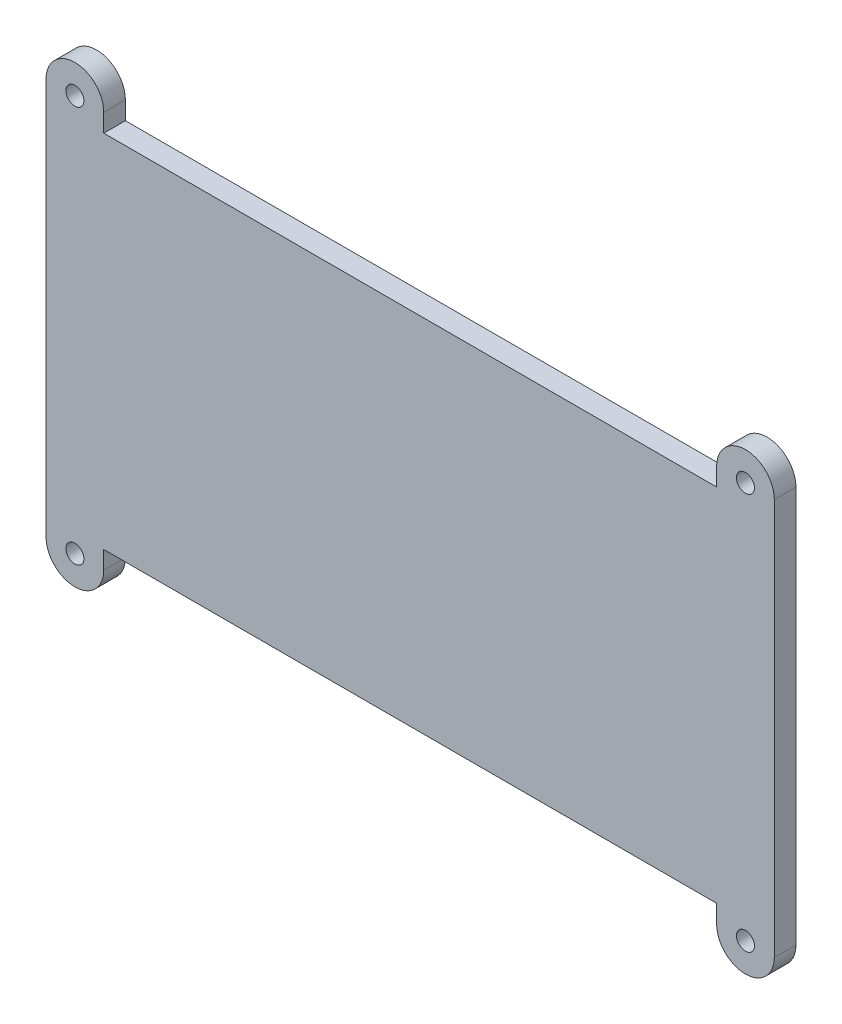
ISO-10303-21;
HEADER;
FILE_DESCRIPTION(('STEP AP214'),'2;1');
FILE_NAME('part.step','',(''),(''),'','','');
FILE_SCHEMA(('AUTOMOTIVE_DESIGN { 1 0 10303 214 1 1 1 1 }'));
ENDSEC;
DATA;
#1=APPLICATION_CONTEXT('core data for automotive mechanical design processes');
#2=APPLICATION_PROTOCOL_DEFINITION('international standard','automotive_design',2000,#1);
#3=PRODUCT_CONTEXT('',#1,'mechanical');
#4=PRODUCT('Part','Part','',(#3));
#5=PRODUCT_RELATED_PRODUCT_CATEGORY('part','',(#4));
#6=PRODUCT_DEFINITION_FORMATION('','',#4);
#7=PRODUCT_DEFINITION_CONTEXT('part definition',#1,'design');
#8=PRODUCT_DEFINITION('design','',#6,#7);
#9=PRODUCT_DEFINITION_SHAPE('','',#8);
#10=(LENGTH_UNIT() NAMED_UNIT(*) SI_UNIT(.MILLI.,.METRE.));
#11=(NAMED_UNIT(*) PLANE_ANGLE_UNIT() SI_UNIT($,.RADIAN.));
#12=(NAMED_UNIT(*) SI_UNIT($,.STERADIAN.) SOLID_ANGLE_UNIT());
#13=UNCERTAINTY_MEASURE_WITH_UNIT(LENGTH_MEASURE(1.E-05),#10,'distance_accuracy_value','');
#14=(GEOMETRIC_REPRESENTATION_CONTEXT(3) GLOBAL_UNCERTAINTY_ASSIGNED_CONTEXT((#13)) GLOBAL_UNIT_ASSIGNED_CONTEXT((#10,
#11,#12)) REPRESENTATION_CONTEXT('',''));
#15=CARTESIAN_POINT('',(0.,0.,0.));
#16=DIRECTION('',(0.,0.,1.));
#17=DIRECTION('',(1.,0.,0.));
#18=AXIS2_PLACEMENT_3D('',#15,#16,#17);
#19=CARTESIAN_POINT('',(46.5,-27.5,3.));
#20=DIRECTION('',(0.,0.,1.));
#21=DIRECTION('',(1.,0.,0.));
#22=AXIS2_PLACEMENT_3D('',#19,#20,#21);
#23=PLANE('',#22);
#24=CARTESIAN_POINT('',(46.5,-27.5,3.));
#25=DIRECTION('',(0.,0.,1.));
#26=DIRECTION('',(1.,0.,0.));
#27=AXIS2_PLACEMENT_3D('',#24,#25,#26);
#28=CIRCLE('',#27,1.25);
#29=CARTESIAN_POINT('',(47.75,-27.5,3.));
#30=VERTEX_POINT('',#29);
#31=EDGE_CURVE('E470',#30,#30,#28,.T.);
#32=ORIENTED_EDGE('',*,*,#31,.F.);
#33=EDGE_LOOP('',(#32));
#34=FACE_BOUND('',#33,.T.);
#35=CARTESIAN_POINT('',(-46.5,27.5,3.));
#36=DIRECTION('',(0.,0.,1.));
#37=DIRECTION('',(1.,0.,0.));
#38=AXIS2_PLACEMENT_3D('',#35,#36,#37);
#39=CIRCLE('',#38,1.25);
#40=CARTESIAN_POINT('',(-45.25,27.5,3.));
#41=VERTEX_POINT('',#40);
#42=EDGE_CURVE('E174',#41,#41,#39,.T.);
#43=ORIENTED_EDGE('',*,*,#42,.F.);
#44=EDGE_LOOP('',(#43));
#45=FACE_BOUND('',#44,.T.);
#46=DIRECTION('',(0.,1.,0.));
#47=VECTOR('',#46,1.);
#48=CARTESIAN_POINT('',(50.5,27.5,3.));
#49=LINE('',#48,#47);
#50=CARTESIAN_POINT('',(50.5,-27.5,3.));
#51=VERTEX_POINT('',#50);
#52=CARTESIAN_POINT('',(50.5,27.5,3.));
#53=VERTEX_POINT('',#52);
#54=EDGE_CURVE('E57',#51,#53,#49,.T.);
#55=ORIENTED_EDGE('',*,*,#54,.T.);
#56=CARTESIAN_POINT('',(46.5,27.5,3.));
#57=DIRECTION('',(0.,0.,1.));
#58=DIRECTION('',(1.,0.,0.));
#59=AXIS2_PLACEMENT_3D('',#56,#57,#58);
#60=CIRCLE('',#59,4.);
#61=CARTESIAN_POINT('',(42.5,27.5,3.));
#62=VERTEX_POINT('',#61);
#63=EDGE_CURVE('E114',#53,#62,#60,.T.);
#64=ORIENTED_EDGE('',*,*,#63,.T.);
#65=DIRECTION('',(0.,-1.,0.));
#66=VECTOR('',#65,1.);
#67=CARTESIAN_POINT('',(42.5,27.5,3.));
#68=LINE('',#67,#66);
#69=CARTESIAN_POINT('',(42.5,25.,3.));
#70=VERTEX_POINT('',#69);
#71=EDGE_CURVE('E241',#62,#70,#68,.T.);
#72=ORIENTED_EDGE('',*,*,#71,.T.);
#73=DIRECTION('',(-1.,0.,0.));
#74=VECTOR('',#73,1.);
#75=CARTESIAN_POINT('',(-42.5,25.,3.));
#76=LINE('',#75,#74);
#77=CARTESIAN_POINT('',(-42.5,25.,3.));
#78=VERTEX_POINT('',#77);
#79=EDGE_CURVE('E259',#70,#78,#76,.T.);
#80=ORIENTED_EDGE('',*,*,#79,.T.);
#81=DIRECTION('',(0.,1.,0.));
#82=VECTOR('',#81,1.);
#83=CARTESIAN_POINT('',(-42.5,27.5,3.));
#84=LINE('',#83,#82);
#85=CARTESIAN_POINT('',(-42.5,27.5,3.));
#86=VERTEX_POINT('',#85);
#87=EDGE_CURVE('E255',#78,#86,#84,.T.);
#88=ORIENTED_EDGE('',*,*,#87,.T.);
#89=CARTESIAN_POINT('',(-46.5,27.5,3.));
#90=DIRECTION('',(0.,0.,1.));
#91=DIRECTION('',(1.,0.,0.));
#92=AXIS2_PLACEMENT_3D('',#89,#90,#91);
#93=CIRCLE('',#92,4.00000000000001);
#94=CARTESIAN_POINT('',(-50.5,27.5,3.));
#95=VERTEX_POINT('',#94);
#96=EDGE_CURVE('E258',#86,#95,#93,.T.);
#97=ORIENTED_EDGE('',*,*,#96,.T.);
#98=DIRECTION('',(0.,-1.,0.));
#99=VECTOR('',#98,1.);
#100=CARTESIAN_POINT('',(-50.5,27.5,3.));
#101=LINE('',#100,#99);
#102=CARTESIAN_POINT('',(-50.5,-27.5,3.));
#103=VERTEX_POINT('',#102);
#104=EDGE_CURVE('E263',#95,#103,#101,.T.);
#105=ORIENTED_EDGE('',*,*,#104,.T.);
#106=CARTESIAN_POINT('',(-46.5,-27.5,3.));
#107=DIRECTION('',(0.,0.,1.));
#108=DIRECTION('',(1.,0.,0.));
#109=AXIS2_PLACEMENT_3D('',#106,#107,#108);
#110=CIRCLE('',#109,4.00000000000001);
#111=CARTESIAN_POINT('',(-42.5,-27.5,3.));
#112=VERTEX_POINT('',#111);
#113=EDGE_CURVE('E270',#103,#112,#110,.T.);
#114=ORIENTED_EDGE('',*,*,#113,.T.);
#115=DIRECTION('',(0.,1.,0.));
#116=VECTOR('',#115,1.);
#117=CARTESIAN_POINT('',(-42.5,-27.5,3.));
#118=LINE('',#117,#116);
#119=CARTESIAN_POINT('',(-42.5,-25.,3.));
#120=VERTEX_POINT('',#119);
#121=EDGE_CURVE('E146',#112,#120,#118,.T.);
#122=ORIENTED_EDGE('',*,*,#121,.T.);
#123=DIRECTION('',(1.,0.,0.));
#124=VECTOR('',#123,1.);
#125=CARTESIAN_POINT('',(-42.5,-25.,3.));
#126=LINE('',#125,#124);
#127=CARTESIAN_POINT('',(42.5,-25.,3.));
#128=VERTEX_POINT('',#127);
#129=EDGE_CURVE('E140',#120,#128,#126,.T.);
#130=ORIENTED_EDGE('',*,*,#129,.T.);
#131=DIRECTION('',(0.,-1.,0.));
#132=VECTOR('',#131,1.);
#133=CARTESIAN_POINT('',(42.5,-27.5,3.));
#134=LINE('',#133,#132);
#135=CARTESIAN_POINT('',(42.5,-27.5,3.));
#136=VERTEX_POINT('',#135);
#137=EDGE_CURVE('E144',#128,#136,#134,.T.);
#138=ORIENTED_EDGE('',*,*,#137,.T.);
#139=CARTESIAN_POINT('',(46.5,-27.5,3.));
#140=DIRECTION('',(0.,0.,1.));
#141=DIRECTION('',(1.,0.,0.));
#142=AXIS2_PLACEMENT_3D('',#139,#140,#141);
#143=CIRCLE('',#142,4.);
#144=EDGE_CURVE('E163',#136,#51,#143,.T.);
#145=ORIENTED_EDGE('',*,*,#144,.T.);
#146=EDGE_LOOP('',(#55,#64,#72,#80,#88,#97,#105,#114,#122,#130,#138,#145));
#147=FACE_BOUND('',#146,.T.);
#148=CARTESIAN_POINT('',(46.5,27.5,3.));
#149=DIRECTION('',(0.,0.,1.));
#150=DIRECTION('',(1.,0.,0.));
#151=AXIS2_PLACEMENT_3D('',#148,#149,#150);
#152=CIRCLE('',#151,1.25);
#153=CARTESIAN_POINT('',(47.75,27.5,3.));
#154=VERTEX_POINT('',#153);
#155=EDGE_CURVE('E478',#154,#154,#152,.T.);
#156=ORIENTED_EDGE('',*,*,#155,.F.);
#157=EDGE_LOOP('',(#156));
#158=FACE_BOUND('',#157,.T.);
#159=CARTESIAN_POINT('',(-46.5,-27.5,3.));
#160=DIRECTION('',(0.,0.,1.));
#161=DIRECTION('',(1.,0.,0.));
#162=AXIS2_PLACEMENT_3D('',#159,#160,#161);
#163=CIRCLE('',#162,1.25);
#164=CARTESIAN_POINT('',(-45.25,-27.5,3.));
#165=VERTEX_POINT('',#164);
#166=EDGE_CURVE('E459',#165,#165,#163,.T.);
#167=ORIENTED_EDGE('',*,*,#166,.F.);
#168=EDGE_LOOP('',(#167));
#169=FACE_BOUND('',#168,.T.);
#170=ADVANCED_FACE('F39',(#34,#45,#147,#158,#169),#23,.T.);
#171=CARTESIAN_POINT('',(46.5,-27.5,0.));
#172=DIRECTION('',(0.,0.,1.));
#173=DIRECTION('',(1.,0.,0.));
#174=AXIS2_PLACEMENT_3D('',#171,#172,#173);
#175=PLANE('',#174);
#176=CARTESIAN_POINT('',(46.5,27.5,0.));
#177=DIRECTION('',(0.,0.,1.));
#178=DIRECTION('',(1.,0.,0.));
#179=AXIS2_PLACEMENT_3D('',#176,#177,#178);
#180=CIRCLE('',#179,4.);
#181=CARTESIAN_POINT('',(50.5,27.5,0.));
#182=VERTEX_POINT('',#181);
#183=CARTESIAN_POINT('',(42.5,27.5,0.));
#184=VERTEX_POINT('',#183);
#185=EDGE_CURVE('E170',#182,#184,#180,.T.);
#186=ORIENTED_EDGE('',*,*,#185,.F.);
#187=DIRECTION('',(0.,1.,0.));
#188=VECTOR('',#187,1.);
#189=CARTESIAN_POINT('',(50.5,-25.,0.));
#190=LINE('',#189,#188);
#191=CARTESIAN_POINT('',(50.5,-27.5,0.));
#192=VERTEX_POINT('',#191);
#193=EDGE_CURVE('E106',#192,#182,#190,.T.);
#194=ORIENTED_EDGE('',*,*,#193,.F.);
#195=CARTESIAN_POINT('',(46.5,-27.5,0.));
#196=DIRECTION('',(0.,0.,1.));
#197=DIRECTION('',(1.,0.,0.));
#198=AXIS2_PLACEMENT_3D('',#195,#196,#197);
#199=CIRCLE('',#198,4.);
#200=CARTESIAN_POINT('',(42.5,-27.5,0.));
#201=VERTEX_POINT('',#200);
#202=EDGE_CURVE('E200',#201,#192,#199,.T.);
#203=ORIENTED_EDGE('',*,*,#202,.F.);
#204=DIRECTION('',(0.,-1.,0.));
#205=VECTOR('',#204,1.);
#206=CARTESIAN_POINT('',(42.5,-27.5,0.));
#207=LINE('',#206,#205);
#208=CARTESIAN_POINT('',(42.5,-25.,0.));
#209=VERTEX_POINT('',#208);
#210=EDGE_CURVE('E99',#209,#201,#207,.T.);
#211=ORIENTED_EDGE('',*,*,#210,.F.);
#212=DIRECTION('',(1.,0.,0.));
#213=VECTOR('',#212,1.);
#214=CARTESIAN_POINT('',(-42.5,-25.,0.));
#215=LINE('',#214,#213);
#216=CARTESIAN_POINT('',(-42.5,-25.,0.));
#217=VERTEX_POINT('',#216);
#218=EDGE_CURVE('E155',#217,#209,#215,.T.);
#219=ORIENTED_EDGE('',*,*,#218,.F.);
#220=DIRECTION('',(0.,1.,0.));
#221=VECTOR('',#220,1.);
#222=CARTESIAN_POINT('',(-42.5,-27.5,0.));
#223=LINE('',#222,#221);
#224=CARTESIAN_POINT('',(-42.5,-27.5,0.));
#225=VERTEX_POINT('',#224);
#226=EDGE_CURVE('E193',#225,#217,#223,.T.);
#227=ORIENTED_EDGE('',*,*,#226,.F.);
#228=CARTESIAN_POINT('',(-46.5,-27.5,0.));
#229=DIRECTION('',(0.,0.,1.));
#230=DIRECTION('',(1.,0.,0.));
#231=AXIS2_PLACEMENT_3D('',#228,#229,#230);
#232=CIRCLE('',#231,4.00000000000001);
#233=CARTESIAN_POINT('',(-50.5,-27.5,0.));
#234=VERTEX_POINT('',#233);
#235=EDGE_CURVE('E190',#234,#225,#232,.T.);
#236=ORIENTED_EDGE('',*,*,#235,.F.);
#237=DIRECTION('',(0.,-1.,0.));
#238=VECTOR('',#237,1.);
#239=CARTESIAN_POINT('',(-50.5,-27.5,0.));
#240=LINE('',#239,#238);
#241=CARTESIAN_POINT('',(-50.5,27.5,0.));
#242=VERTEX_POINT('',#241);
#243=EDGE_CURVE('E187',#242,#234,#240,.T.);
#244=ORIENTED_EDGE('',*,*,#243,.F.);
#245=CARTESIAN_POINT('',(-46.5,27.5,0.));
#246=DIRECTION('',(0.,0.,1.));
#247=DIRECTION('',(1.,0.,0.));
#248=AXIS2_PLACEMENT_3D('',#245,#246,#247);
#249=CIRCLE('',#248,4.00000000000001);
#250=CARTESIAN_POINT('',(-42.5,27.5,0.));
#251=VERTEX_POINT('',#250);
#252=EDGE_CURVE('E183',#251,#242,#249,.T.);
#253=ORIENTED_EDGE('',*,*,#252,.F.);
#254=DIRECTION('',(0.,1.,0.));
#255=VECTOR('',#254,1.);
#256=CARTESIAN_POINT('',(-42.5,27.5,0.));
#257=LINE('',#256,#255);
#258=CARTESIAN_POINT('',(-42.5,25.,0.));
#259=VERTEX_POINT('',#258);
#260=EDGE_CURVE('E180',#259,#251,#257,.T.);
#261=ORIENTED_EDGE('',*,*,#260,.F.);
#262=DIRECTION('',(-1.,0.,0.));
#263=VECTOR('',#262,1.);
#264=CARTESIAN_POINT('',(-42.5,25.,0.));
#265=LINE('',#264,#263);
#266=CARTESIAN_POINT('',(42.5,25.,0.));
#267=VERTEX_POINT('',#266);
#268=EDGE_CURVE('E177',#267,#259,#265,.T.);
#269=ORIENTED_EDGE('',*,*,#268,.F.);
#270=DIRECTION('',(0.,-1.,0.));
#271=VECTOR('',#270,1.);
#272=CARTESIAN_POINT('',(42.5,27.5,0.));
#273=LINE('',#272,#271);
#274=EDGE_CURVE('E173',#184,#267,#273,.T.);
#275=ORIENTED_EDGE('',*,*,#274,.F.);
#276=EDGE_LOOP('',(#186,#194,#203,#211,#219,#227,#236,#244,#253,#261,#269,#275));
#277=FACE_BOUND('',#276,.T.);
#278=CARTESIAN_POINT('',(-46.5,27.5,0.));
#279=DIRECTION('',(0.,0.,1.));
#280=DIRECTION('',(1.,0.,0.));
#281=AXIS2_PLACEMENT_3D('',#278,#279,#280);
#282=CIRCLE('',#281,1.25);
#283=CARTESIAN_POINT('',(-45.25,27.5,0.));
#284=VERTEX_POINT('',#283);
#285=EDGE_CURVE('E482',#284,#284,#282,.T.);
#286=ORIENTED_EDGE('',*,*,#285,.T.);
#287=EDGE_LOOP('',(#286));
#288=FACE_BOUND('',#287,.T.);
#289=CARTESIAN_POINT('',(46.5,27.5,0.));
#290=DIRECTION('',(0.,0.,1.));
#291=DIRECTION('',(1.,0.,0.));
#292=AXIS2_PLACEMENT_3D('',#289,#290,#291);
#293=CIRCLE('',#292,1.25);
#294=CARTESIAN_POINT('',(47.75,27.5,0.));
#295=VERTEX_POINT('',#294);
#296=EDGE_CURVE('E474',#295,#295,#293,.T.);
#297=ORIENTED_EDGE('',*,*,#296,.T.);
#298=EDGE_LOOP('',(#297));
#299=FACE_BOUND('',#298,.T.);
#300=CARTESIAN_POINT('',(46.5,-27.5,0.));
#301=DIRECTION('',(0.,0.,1.));
#302=DIRECTION('',(1.,0.,0.));
#303=AXIS2_PLACEMENT_3D('',#300,#301,#302);
#304=CIRCLE('',#303,1.25);
#305=CARTESIAN_POINT('',(47.75,-27.5,0.));
#306=VERTEX_POINT('',#305);
#307=EDGE_CURVE('E467',#306,#306,#304,.T.);
#308=ORIENTED_EDGE('',*,*,#307,.T.);
#309=EDGE_LOOP('',(#308));
#310=FACE_BOUND('',#309,.T.);
#311=CARTESIAN_POINT('',(-46.5,-27.5,0.));
#312=DIRECTION('',(0.,0.,1.));
#313=DIRECTION('',(1.,0.,0.));
#314=AXIS2_PLACEMENT_3D('',#311,#312,#313);
#315=CIRCLE('',#314,1.25);
#316=CARTESIAN_POINT('',(-45.25,-27.5,0.));
#317=VERTEX_POINT('',#316);
#318=EDGE_CURVE('E462',#317,#317,#315,.T.);
#319=ORIENTED_EDGE('',*,*,#318,.T.);
#320=EDGE_LOOP('',(#319));
#321=FACE_BOUND('',#320,.T.);
#322=ADVANCED_FACE('F243',(#277,#288,#299,#310,#321),#175,.F.);
#323=CARTESIAN_POINT('',(46.5,27.5,3.));
#324=DIRECTION('',(0.,0.,-1.));
#325=DIRECTION('',(-1.,0.,0.));
#326=AXIS2_PLACEMENT_3D('',#323,#324,#325);
#327=CYLINDRICAL_SURFACE('',#326,4.);
#328=ORIENTED_EDGE('',*,*,#185,.T.);
#329=DIRECTION('',(0.,0.,-1.));
#330=VECTOR('',#329,1.);
#331=CARTESIAN_POINT('',(42.5,27.5,3.));
#332=LINE('',#331,#330);
#333=EDGE_CURVE('E49',#62,#184,#332,.T.);
#334=ORIENTED_EDGE('',*,*,#333,.F.);
#335=ORIENTED_EDGE('',*,*,#63,.F.);
#336=DIRECTION('',(0.,0.,-1.));
#337=VECTOR('',#336,1.);
#338=CARTESIAN_POINT('',(50.5,27.5,3.));
#339=LINE('',#338,#337);
#340=EDGE_CURVE('E11',#53,#182,#339,.T.);
#341=ORIENTED_EDGE('',*,*,#340,.T.);
#342=EDGE_LOOP('',(#328,#334,#335,#341));
#343=FACE_BOUND('',#342,.T.);
#344=ADVANCED_FACE('F41',(#343),#327,.T.);
#345=CARTESIAN_POINT('',(42.5,27.5,3.));
#346=DIRECTION('',(1.,0.,0.));
#347=DIRECTION('',(0.,0.,-1.));
#348=AXIS2_PLACEMENT_3D('',#345,#346,#347);
#349=PLANE('',#348);
#350=ORIENTED_EDGE('',*,*,#274,.T.);
#351=DIRECTION('',(0.,0.,-1.));
#352=VECTOR('',#351,1.);
#353=CARTESIAN_POINT('',(42.5,25.,3.));
#354=LINE('',#353,#352);
#355=EDGE_CURVE('E231',#70,#267,#354,.T.);
#356=ORIENTED_EDGE('',*,*,#355,.F.);
#357=ORIENTED_EDGE('',*,*,#71,.F.);
#358=ORIENTED_EDGE('',*,*,#333,.T.);
#359=EDGE_LOOP('',(#350,#356,#357,#358));
#360=FACE_BOUND('',#359,.T.);
#361=ADVANCED_FACE('F239',(#360),#349,.F.);
#362=CARTESIAN_POINT('',(-42.5,25.,3.));
#363=DIRECTION('',(0.,-1.,0.));
#364=DIRECTION('',(0.,0.,-1.));
#365=AXIS2_PLACEMENT_3D('',#362,#363,#364);
#366=PLANE('',#365);
#367=ORIENTED_EDGE('',*,*,#268,.T.);
#368=DIRECTION('',(0.,0.,-1.));
#369=VECTOR('',#368,1.);
#370=CARTESIAN_POINT('',(-42.5,25.,3.));
#371=LINE('',#370,#369);
#372=EDGE_CURVE('E227',#78,#259,#371,.T.);
#373=ORIENTED_EDGE('',*,*,#372,.F.);
#374=ORIENTED_EDGE('',*,*,#79,.F.);
#375=ORIENTED_EDGE('',*,*,#355,.T.);
#376=EDGE_LOOP('',(#367,#373,#374,#375));
#377=FACE_BOUND('',#376,.T.);
#378=ADVANCED_FACE('F249',(#377),#366,.F.);
#379=CARTESIAN_POINT('',(-42.5,27.5,3.));
#380=DIRECTION('',(-1.,0.,0.));
#381=DIRECTION('',(0.,0.,1.));
#382=AXIS2_PLACEMENT_3D('',#379,#380,#381);
#383=PLANE('',#382);
#384=ORIENTED_EDGE('',*,*,#260,.T.);
#385=DIRECTION('',(0.,0.,-1.));
#386=VECTOR('',#385,1.);
#387=CARTESIAN_POINT('',(-42.5,27.5,3.));
#388=LINE('',#387,#386);
#389=EDGE_CURVE('E223',#86,#251,#388,.T.);
#390=ORIENTED_EDGE('',*,*,#389,.F.);
#391=ORIENTED_EDGE('',*,*,#87,.F.);
#392=ORIENTED_EDGE('',*,*,#372,.T.);
#393=EDGE_LOOP('',(#384,#390,#391,#392));
#394=FACE_BOUND('',#393,.T.);
#395=ADVANCED_FACE('F253',(#394),#383,.F.);
#396=CARTESIAN_POINT('',(-46.5,27.5,3.));
#397=DIRECTION('',(0.,0.,-1.));
#398=DIRECTION('',(-1.,0.,0.));
#399=AXIS2_PLACEMENT_3D('',#396,#397,#398);
#400=CYLINDRICAL_SURFACE('',#399,4.00000000000001);
#401=ORIENTED_EDGE('',*,*,#252,.T.);
#402=DIRECTION('',(0.,0.,-1.));
#403=VECTOR('',#402,1.);
#404=CARTESIAN_POINT('',(-50.5,27.5,3.));
#405=LINE('',#404,#403);
#406=EDGE_CURVE('E219',#95,#242,#405,.T.);
#407=ORIENTED_EDGE('',*,*,#406,.F.);
#408=ORIENTED_EDGE('',*,*,#96,.F.);
#409=ORIENTED_EDGE('',*,*,#389,.T.);
#410=EDGE_LOOP('',(#401,#407,#408,#409));
#411=FACE_BOUND('',#410,.T.);
#412=ADVANCED_FACE('F319',(#411),#400,.T.);
#413=CARTESIAN_POINT('',(-50.5,-27.5,3.));
#414=DIRECTION('',(1.,0.,0.));
#415=DIRECTION('',(0.,0.,-1.));
#416=AXIS2_PLACEMENT_3D('',#413,#414,#415);
#417=PLANE('',#416);
#418=ORIENTED_EDGE('',*,*,#243,.T.);
#419=DIRECTION('',(0.,0.,-1.));
#420=VECTOR('',#419,1.);
#421=CARTESIAN_POINT('',(-50.5,-27.5,3.));
#422=LINE('',#421,#420);
#423=EDGE_CURVE('E215',#103,#234,#422,.T.);
#424=ORIENTED_EDGE('',*,*,#423,.F.);
#425=ORIENTED_EDGE('',*,*,#104,.F.);
#426=ORIENTED_EDGE('',*,*,#406,.T.);
#427=EDGE_LOOP('',(#418,#424,#425,#426));
#428=FACE_BOUND('',#427,.T.);
#429=ADVANCED_FACE('F316',(#428),#417,.F.);
#430=CARTESIAN_POINT('',(-46.5,-27.5,3.));
#431=DIRECTION('',(0.,0.,-1.));
#432=DIRECTION('',(-1.,0.,0.));
#433=AXIS2_PLACEMENT_3D('',#430,#431,#432);
#434=CYLINDRICAL_SURFACE('',#433,4.00000000000001);
#435=ORIENTED_EDGE('',*,*,#235,.T.);
#436=DIRECTION('',(0.,0.,-1.));
#437=VECTOR('',#436,1.);
#438=CARTESIAN_POINT('',(-42.5,-27.5,3.));
#439=LINE('',#438,#437);
#440=EDGE_CURVE('E211',#112,#225,#439,.T.);
#441=ORIENTED_EDGE('',*,*,#440,.F.);
#442=ORIENTED_EDGE('',*,*,#113,.F.);
#443=ORIENTED_EDGE('',*,*,#423,.T.);
#444=EDGE_LOOP('',(#435,#441,#442,#443));
#445=FACE_BOUND('',#444,.T.);
#446=ADVANCED_FACE('F278',(#445),#434,.T.);
#447=CARTESIAN_POINT('',(-42.5,-27.5,3.));
#448=DIRECTION('',(-1.,0.,0.));
#449=DIRECTION('',(0.,0.,1.));
#450=AXIS2_PLACEMENT_3D('',#447,#448,#449);
#451=PLANE('',#450);
#452=ORIENTED_EDGE('',*,*,#226,.T.);
#453=DIRECTION('',(0.,0.,-1.));
#454=VECTOR('',#453,1.);
#455=CARTESIAN_POINT('',(-42.5,-25.,3.));
#456=LINE('',#455,#454);
#457=EDGE_CURVE('E157',#120,#217,#456,.T.);
#458=ORIENTED_EDGE('',*,*,#457,.F.);
#459=ORIENTED_EDGE('',*,*,#121,.F.);
#460=ORIENTED_EDGE('',*,*,#440,.T.);
#461=EDGE_LOOP('',(#452,#458,#459,#460));
#462=FACE_BOUND('',#461,.T.);
#463=ADVANCED_FACE('F282',(#462),#451,.F.);
#464=CARTESIAN_POINT('',(-42.5,-25.,3.));
#465=DIRECTION('',(0.,1.,0.));
#466=DIRECTION('',(0.,0.,1.));
#467=AXIS2_PLACEMENT_3D('',#464,#465,#466);
#468=PLANE('',#467);
#469=ORIENTED_EDGE('',*,*,#218,.T.);
#470=DIRECTION('',(0.,0.,-1.));
#471=VECTOR('',#470,1.);
#472=CARTESIAN_POINT('',(42.5,-25.,3.));
#473=LINE('',#472,#471);
#474=EDGE_CURVE('E152',#128,#209,#473,.T.);
#475=ORIENTED_EDGE('',*,*,#474,.F.);
#476=ORIENTED_EDGE('',*,*,#129,.F.);
#477=ORIENTED_EDGE('',*,*,#457,.T.);
#478=EDGE_LOOP('',(#469,#475,#476,#477));
#479=FACE_BOUND('',#478,.T.);
#480=ADVANCED_FACE('F153',(#479),#468,.F.);
#481=CARTESIAN_POINT('',(42.5,-27.5,3.));
#482=DIRECTION('',(1.,0.,0.));
#483=DIRECTION('',(0.,0.,-1.));
#484=AXIS2_PLACEMENT_3D('',#481,#482,#483);
#485=PLANE('',#484);
#486=ORIENTED_EDGE('',*,*,#210,.T.);
#487=DIRECTION('',(0.,0.,-1.));
#488=VECTOR('',#487,1.);
#489=CARTESIAN_POINT('',(42.5,-27.5,3.));
#490=LINE('',#489,#488);
#491=EDGE_CURVE('E158',#136,#201,#490,.T.);
#492=ORIENTED_EDGE('',*,*,#491,.F.);
#493=ORIENTED_EDGE('',*,*,#137,.F.);
#494=ORIENTED_EDGE('',*,*,#474,.T.);
#495=EDGE_LOOP('',(#486,#492,#493,#494));
#496=FACE_BOUND('',#495,.T.);
#497=ADVANCED_FACE('F160',(#496),#485,.F.);
#498=CARTESIAN_POINT('',(46.5,-27.5,3.));
#499=DIRECTION('',(0.,0.,-1.));
#500=DIRECTION('',(-1.,0.,0.));
#501=AXIS2_PLACEMENT_3D('',#498,#499,#500);
#502=CYLINDRICAL_SURFACE('',#501,4.);
#503=ORIENTED_EDGE('',*,*,#202,.T.);
#504=DIRECTION('',(0.,0.,-1.));
#505=VECTOR('',#504,1.);
#506=CARTESIAN_POINT('',(50.5,-27.5,3.));
#507=LINE('',#506,#505);
#508=EDGE_CURVE('E166',#51,#192,#507,.T.);
#509=ORIENTED_EDGE('',*,*,#508,.F.);
#510=ORIENTED_EDGE('',*,*,#144,.F.);
#511=ORIENTED_EDGE('',*,*,#491,.T.);
#512=EDGE_LOOP('',(#503,#509,#510,#511));
#513=FACE_BOUND('',#512,.T.);
#514=ADVANCED_FACE('F285',(#513),#502,.T.);
#515=CARTESIAN_POINT('',(50.5,-25.,3.));
#516=DIRECTION('',(-1.,0.,0.));
#517=DIRECTION('',(0.,0.,1.));
#518=AXIS2_PLACEMENT_3D('',#515,#516,#517);
#519=PLANE('',#518);
#520=ORIENTED_EDGE('',*,*,#193,.T.);
#521=ORIENTED_EDGE('',*,*,#340,.F.);
#522=ORIENTED_EDGE('',*,*,#54,.F.);
#523=ORIENTED_EDGE('',*,*,#508,.T.);
#524=EDGE_LOOP('',(#520,#521,#522,#523));
#525=FACE_BOUND('',#524,.T.);
#526=ADVANCED_FACE('F286',(#525),#519,.F.);
#527=CARTESIAN_POINT('',(-46.5,27.5,3.));
#528=DIRECTION('',(0.,0.,-1.));
#529=DIRECTION('',(-1.,0.,0.));
#530=AXIS2_PLACEMENT_3D('',#527,#528,#529);
#531=CYLINDRICAL_SURFACE('',#530,1.25);
#532=ORIENTED_EDGE('',*,*,#42,.T.);
#533=EDGE_LOOP('',(#532));
#534=FACE_BOUND('',#533,.T.);
#535=ORIENTED_EDGE('',*,*,#285,.F.);
#536=EDGE_LOOP('',(#535));
#537=FACE_BOUND('',#536,.T.);
#538=ADVANCED_FACE('F301',(#534,#537),#531,.F.);
#539=CARTESIAN_POINT('',(46.5,27.5,3.));
#540=DIRECTION('',(0.,0.,-1.));
#541=DIRECTION('',(-1.,0.,0.));
#542=AXIS2_PLACEMENT_3D('',#539,#540,#541);
#543=CYLINDRICAL_SURFACE('',#542,1.25);
#544=ORIENTED_EDGE('',*,*,#155,.T.);
#545=EDGE_LOOP('',(#544));
#546=FACE_BOUND('',#545,.T.);
#547=ORIENTED_EDGE('',*,*,#296,.F.);
#548=EDGE_LOOP('',(#547));
#549=FACE_BOUND('',#548,.T.);
#550=ADVANCED_FACE('F373',(#546,#549),#543,.F.);
#551=CARTESIAN_POINT('',(46.5,-27.5,3.));
#552=DIRECTION('',(0.,0.,-1.));
#553=DIRECTION('',(-1.,0.,0.));
#554=AXIS2_PLACEMENT_3D('',#551,#552,#553);
#555=CYLINDRICAL_SURFACE('',#554,1.25);
#556=ORIENTED_EDGE('',*,*,#31,.T.);
#557=EDGE_LOOP('',(#556));
#558=FACE_BOUND('',#557,.T.);
#559=ORIENTED_EDGE('',*,*,#307,.F.);
#560=EDGE_LOOP('',(#559));
#561=FACE_BOUND('',#560,.T.);
#562=ADVANCED_FACE('F380',(#558,#561),#555,.F.);
#563=CARTESIAN_POINT('',(-46.5,-27.5,3.));
#564=DIRECTION('',(0.,0.,-1.));
#565=DIRECTION('',(-1.,0.,0.));
#566=AXIS2_PLACEMENT_3D('',#563,#564,#565);
#567=CYLINDRICAL_SURFACE('',#566,1.25);
#568=ORIENTED_EDGE('',*,*,#166,.T.);
#569=EDGE_LOOP('',(#568));
#570=FACE_BOUND('',#569,.T.);
#571=ORIENTED_EDGE('',*,*,#318,.F.);
#572=EDGE_LOOP('',(#571));
#573=FACE_BOUND('',#572,.T.);
#574=ADVANCED_FACE('F387',(#570,#573),#567,.F.);
#575=CLOSED_SHELL('',(#170,#322,#344,#361,#378,#395,#412,#429,#446,#463,#480,#497,#514,#526,
#538,#550,#562,#574));
#576=MANIFOLD_SOLID_BREP('B2',#575);
#577=ADVANCED_BREP_SHAPE_REPRESENTATION('',(#18,#576),#14);
#578=SHAPE_DEFINITION_REPRESENTATION(#9,#577);
ENDSEC;
END-ISO-10303-21;
